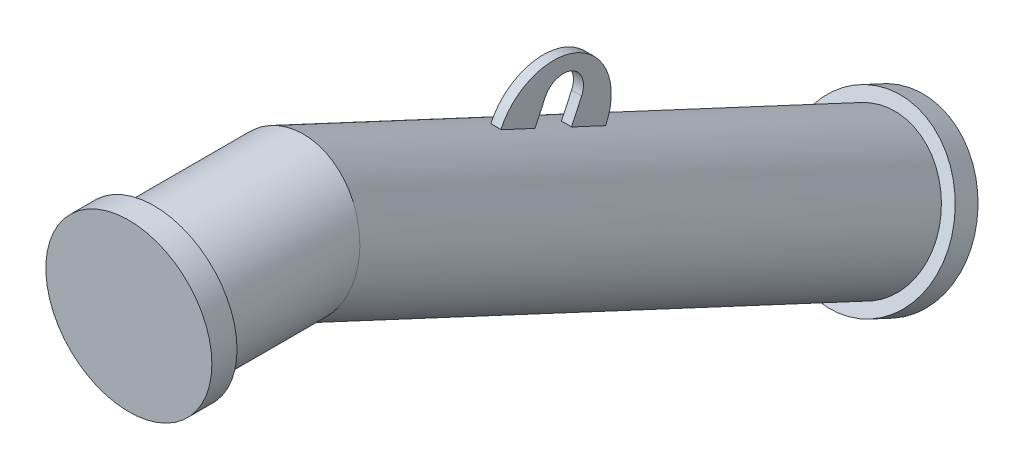
ISO-10303-21;
HEADER;
FILE_DESCRIPTION(('STEP AP214'),'2;1');
FILE_NAME('part.step','',(''),(''),'','','');
FILE_SCHEMA(('AUTOMOTIVE_DESIGN { 1 0 10303 214 1 1 1 1 }'));
ENDSEC;
DATA;
#1=APPLICATION_CONTEXT('core data for automotive mechanical design processes');
#2=APPLICATION_PROTOCOL_DEFINITION('international standard','automotive_design',2000,#1);
#3=PRODUCT_CONTEXT('',#1,'mechanical');
#4=PRODUCT('Part','Part','',(#3));
#5=PRODUCT_RELATED_PRODUCT_CATEGORY('part','',(#4));
#6=PRODUCT_DEFINITION_FORMATION('','',#4);
#7=PRODUCT_DEFINITION_CONTEXT('part definition',#1,'design');
#8=PRODUCT_DEFINITION('design','',#6,#7);
#9=PRODUCT_DEFINITION_SHAPE('','',#8);
#10=(LENGTH_UNIT() NAMED_UNIT(*) SI_UNIT(.MILLI.,.METRE.));
#11=(NAMED_UNIT(*) PLANE_ANGLE_UNIT() SI_UNIT($,.RADIAN.));
#12=(NAMED_UNIT(*) SI_UNIT($,.STERADIAN.) SOLID_ANGLE_UNIT());
#13=UNCERTAINTY_MEASURE_WITH_UNIT(LENGTH_MEASURE(1.E-05),#10,'distance_accuracy_value','');
#14=(GEOMETRIC_REPRESENTATION_CONTEXT(3) GLOBAL_UNCERTAINTY_ASSIGNED_CONTEXT((#13)) GLOBAL_UNIT_ASSIGNED_CONTEXT((#10,
#11,#12)) REPRESENTATION_CONTEXT('',''));
#15=CARTESIAN_POINT('',(0.,0.,0.));
#16=DIRECTION('',(0.,0.,1.));
#17=DIRECTION('',(1.,0.,0.));
#18=AXIS2_PLACEMENT_3D('',#15,#16,#17);
#19=CARTESIAN_POINT('',(5.00000000004126,-35.0356088594968,-398.785014069942));
#20=DIRECTION('',(0.,0.422618261740708,0.906307787036644));
#21=DIRECTION('',(0.,-0.906307787036647,0.42261826174071));
#22=AXIS2_PLACEMENT_3D('',#19,#20,#21);
#23=PLANE('',#22);
#24=DIRECTION('',(0.,0.906307787036647,-0.42261826174071));
#25=VECTOR('',#24,1.);
#26=CARTESIAN_POINT('',(5.00000000004126,-35.0356088594968,-398.785014069942));
#27=LINE('',#26,#25);
#28=CARTESIAN_POINT('',(5.00000000004056,-35.3339515462032,-398.645894590376));
#29=VERTEX_POINT('',#28);
#30=CARTESIAN_POINT('',(5.00000000004129,-13.7373758641353,-408.716543220848));
#31=VERTEX_POINT('',#30);
#32=EDGE_CURVE('E249',#29,#31,#27,.T.);
#33=ORIENTED_EDGE('',*,*,#32,.F.);
#34=CARTESIAN_POINT('',(0.,-98.4771539520796,-369.201735748084));
#35=DIRECTION('',(0.,0.422618261740708,0.906307787036644));
#36=DIRECTION('',(0.,-0.906307787036646,0.422618261740709));
#37=AXIS2_PLACEMENT_3D('',#34,#35,#36);
#38=CIRCLE('',#37,69.85);
#39=CARTESIAN_POINT('',(-4.99999999995944,-35.3339515461978,-398.645894590378));
#40=VERTEX_POINT('',#39);
#41=EDGE_CURVE('E224',#29,#40,#38,.T.);
#42=ORIENTED_EDGE('',*,*,#41,.T.);
#43=DIRECTION('',(0.,0.906307787036647,-0.42261826174071));
#44=VECTOR('',#43,1.);
#45=CARTESIAN_POINT('',(-4.99999999995874,-35.0356088594966,-398.785014069941));
#46=LINE('',#45,#44);
#47=CARTESIAN_POINT('',(-4.99999999995871,-13.7373758641352,-408.716543220848));
#48=VERTEX_POINT('',#47);
#49=EDGE_CURVE('E248',#40,#48,#46,.T.);
#50=ORIENTED_EDGE('',*,*,#49,.T.);
#51=DIRECTION('',(-1.,0.,0.));
#52=VECTOR('',#51,1.);
#53=CARTESIAN_POINT('',(5.00000000004129,-13.7373758641353,-408.716543220848));
#54=LINE('',#53,#52);
#55=EDGE_CURVE('E25',#31,#48,#54,.T.);
#56=ORIENTED_EDGE('',*,*,#55,.F.);
#57=EDGE_LOOP('',(#33,#42,#50,#56));
#58=FACE_BOUND('',#57,.T.);
#59=ADVANCED_FACE('F16',(#58),#23,.F.);
#60=CARTESIAN_POINT('',(5.00000000004135,-22.1897410989496,-426.842698961581));
#61=DIRECTION('',(-1.,0.,0.));
#62=DIRECTION('',(0.,-0.906307787036648,0.42261826174071));
#63=AXIS2_PLACEMENT_3D('',#60,#61,#62);
#64=CYLINDRICAL_SURFACE('',#63,20.);
#65=CARTESIAN_POINT('',(-4.99999999995866,-22.1897410989496,-426.842698961581));
#66=DIRECTION('',(-1.,0.,0.));
#67=DIRECTION('',(0.,0.906307787036648,-0.42261826174071));
#68=AXIS2_PLACEMENT_3D('',#65,#66,#67);
#69=CIRCLE('',#68,20.);
#70=CARTESIAN_POINT('',(-4.99999999995858,-30.6421063337638,-444.968854702314));
#71=VERTEX_POINT('',#70);
#72=EDGE_CURVE('E266',#48,#71,#69,.T.);
#73=ORIENTED_EDGE('',*,*,#72,.T.);
#74=DIRECTION('',(-1.,0.,0.));
#75=VECTOR('',#74,1.);
#76=CARTESIAN_POINT('',(5.00000000004142,-30.6421063337638,-444.968854702315));
#77=LINE('',#76,#75);
#78=CARTESIAN_POINT('',(5.00000000004142,-30.6421063337638,-444.968854702315));
#79=VERTEX_POINT('',#78);
#80=EDGE_CURVE('E283',#79,#71,#77,.T.);
#81=ORIENTED_EDGE('',*,*,#80,.F.);
#82=CARTESIAN_POINT('',(5.00000000004135,-22.1897410989496,-426.842698961581));
#83=DIRECTION('',(-1.,0.,0.));
#84=DIRECTION('',(0.,0.906307787036648,-0.42261826174071));
#85=AXIS2_PLACEMENT_3D('',#82,#83,#84);
#86=CIRCLE('',#85,20.);
#87=EDGE_CURVE('E252',#31,#79,#86,.T.);
#88=ORIENTED_EDGE('',*,*,#87,.F.);
#89=ORIENTED_EDGE('',*,*,#55,.T.);
#90=EDGE_LOOP('',(#73,#81,#88,#89));
#91=FACE_BOUND('',#90,.T.);
#92=ADVANCED_FACE('F296',(#91),#64,.F.);
#93=CARTESIAN_POINT('',(5.0000000000414,-51.940339329125,-435.037325551408));
#94=DIRECTION('',(0.,-0.422618261740708,-0.906307787036644));
#95=DIRECTION('',(0.,0.906307787036647,-0.42261826174071));
#96=AXIS2_PLACEMENT_3D('',#93,#94,#95);
#97=PLANE('',#96);
#98=DIRECTION('',(0.,-0.906307787036647,0.42261826174071));
#99=VECTOR('',#98,1.);
#100=CARTESIAN_POINT('',(-4.9999999999586,-51.9403393291251,-435.037325551408));
#101=LINE('',#100,#99);
#102=CARTESIAN_POINT('',(-4.99999999995937,-52.2386820158263,-434.898206071845));
#103=VERTEX_POINT('',#102);
#104=EDGE_CURVE('E269',#71,#103,#101,.T.);
#105=ORIENTED_EDGE('',*,*,#104,.T.);
#106=CARTESIAN_POINT('',(0.,-115.381884421708,-405.45404722955));
#107=DIRECTION('',(0.,-0.422618261740708,-0.906307787036644));
#108=DIRECTION('',(0.,0.906307787036646,-0.422618261740709));
#109=AXIS2_PLACEMENT_3D('',#106,#107,#108);
#110=CIRCLE('',#109,69.85);
#111=CARTESIAN_POINT('',(5.00000000004063,-52.2386820158313,-434.898206071842));
#112=VERTEX_POINT('',#111);
#113=EDGE_CURVE('E232',#103,#112,#110,.T.);
#114=ORIENTED_EDGE('',*,*,#113,.T.);
#115=DIRECTION('',(0.,-0.906307787036647,0.42261826174071));
#116=VECTOR('',#115,1.);
#117=CARTESIAN_POINT('',(5.0000000000414,-51.940339329125,-435.037325551408));
#118=LINE('',#117,#116);
#119=EDGE_CURVE('E256',#79,#112,#118,.T.);
#120=ORIENTED_EDGE('',*,*,#119,.F.);
#121=ORIENTED_EDGE('',*,*,#80,.T.);
#122=EDGE_LOOP('',(#105,#114,#120,#121));
#123=FACE_BOUND('',#122,.T.);
#124=ADVANCED_FACE('F306',(#123),#97,.F.);
#125=CARTESIAN_POINT('',(5.00000000004133,-43.4879740943109,-416.911169810675));
#126=DIRECTION('',(-1.,0.,0.));
#127=DIRECTION('',(0.,-0.906307787036648,0.42261826174071));
#128=AXIS2_PLACEMENT_3D('',#125,#126,#127);
#129=CYLINDRICAL_SURFACE('',#128,57.5);
#130=CARTESIAN_POINT('',(-4.99999999995867,-43.4879740943108,-416.911169810675));
#131=DIRECTION('',(1.,0.,0.));
#132=DIRECTION('',(0.,0.906307787036648,-0.42261826174071));
#133=AXIS2_PLACEMENT_3D('',#130,#131,#132);
#134=CIRCLE('',#133,57.5);
#135=CARTESIAN_POINT('',(-4.99999999995846,-67.7885241444018,-469.023867565282));
#136=VERTEX_POINT('',#135);
#137=CARTESIAN_POINT('',(-4.99999999995888,-19.1874240442202,-364.798472056067));
#138=VERTEX_POINT('',#137);
#139=EDGE_CURVE('E253',#136,#138,#134,.T.);
#140=ORIENTED_EDGE('',*,*,#139,.T.);
#141=DIRECTION('',(-1.,0.,0.));
#142=VECTOR('',#141,1.);
#143=CARTESIAN_POINT('',(5.00000000004112,-19.1874240442203,-364.798472056068));
#144=LINE('',#143,#142);
#145=CARTESIAN_POINT('',(5.00000000004112,-19.1874240442203,-364.798472056068));
#146=VERTEX_POINT('',#145);
#147=EDGE_CURVE('E263',#146,#138,#144,.T.);
#148=ORIENTED_EDGE('',*,*,#147,.F.);
#149=CARTESIAN_POINT('',(5.00000000004133,-43.4879740943109,-416.911169810675));
#150=DIRECTION('',(1.,0.,0.));
#151=DIRECTION('',(0.,0.906307787036648,-0.42261826174071));
#152=AXIS2_PLACEMENT_3D('',#149,#150,#151);
#153=CIRCLE('',#152,57.5);
#154=CARTESIAN_POINT('',(5.00000000004154,-67.7885241444016,-469.023867565282));
#155=VERTEX_POINT('',#154);
#156=EDGE_CURVE('E259',#155,#146,#153,.T.);
#157=ORIENTED_EDGE('',*,*,#156,.F.);
#158=DIRECTION('',(-1.,0.,0.));
#159=VECTOR('',#158,1.);
#160=CARTESIAN_POINT('',(5.00000000004154,-67.7885241444016,-469.023867565282));
#161=LINE('',#160,#159);
#162=EDGE_CURVE('E279',#155,#136,#161,.T.);
#163=ORIENTED_EDGE('',*,*,#162,.T.);
#164=EDGE_LOOP('',(#140,#148,#157,#163));
#165=FACE_BOUND('',#164,.T.);
#166=ADVANCED_FACE('F322',(#165),#129,.T.);
#167=CARTESIAN_POINT('',(5.00000000004135,-22.1897410989496,-426.842698961581));
#168=DIRECTION('',(1.,0.,0.));
#169=DIRECTION('',(0.,0.906307787036648,-0.42261826174071));
#170=AXIS2_PLACEMENT_3D('',#167,#168,#169);
#171=PLANE('',#170);
#172=DIRECTION('',(0.,-0.4226182617407,-0.90630778703665));
#173=VECTOR('',#172,1.);
#174=CARTESIAN_POINT('',(5.00000000003986,133.225200600753,-37.1696262960046));
#175=LINE('',#174,#173);
#176=CARTESIAN_POINT('',(5.00000000004154,-68.0868668311076,-468.884748085716));
#177=VERTEX_POINT('',#176);
#178=EDGE_CURVE('E225',#177,#112,#175,.F.);
#179=ORIENTED_EDGE('',*,*,#178,.F.);
#180=DIRECTION('',(0.,0.906307787036645,-0.422618261740709));
#181=VECTOR('',#180,1.);
#182=CARTESIAN_POINT('',(5.00000000004154,-76.8516020147681,-464.797684947875));
#183=LINE('',#182,#181);
#184=EDGE_CURVE('E242',#177,#155,#183,.T.);
#185=ORIENTED_EDGE('',*,*,#184,.T.);
#186=ORIENTED_EDGE('',*,*,#156,.T.);
#187=DIRECTION('',(0.,0.906307787036645,-0.422618261740709));
#188=VECTOR('',#187,1.);
#189=CARTESIAN_POINT('',(5.00000000004111,-28.2505019145867,-360.572289438661));
#190=LINE('',#189,#188);
#191=CARTESIAN_POINT('',(5.00000000004112,-19.4857667309272,-364.659352576502));
#192=VERTEX_POINT('',#191);
#193=EDGE_CURVE('E236',#192,#146,#190,.T.);
#194=ORIENTED_EDGE('',*,*,#193,.F.);
#195=EDGE_CURVE('E49',#29,#192,#175,.F.);
#196=ORIENTED_EDGE('',*,*,#195,.F.);
#197=ORIENTED_EDGE('',*,*,#32,.T.);
#198=ORIENTED_EDGE('',*,*,#87,.T.);
#199=ORIENTED_EDGE('',*,*,#119,.T.);
#200=EDGE_LOOP('',(#179,#185,#186,#194,#196,#197,#198,#199));
#201=FACE_BOUND('',#200,.T.);
#202=ADVANCED_FACE('F310',(#201),#171,.T.);
#203=CARTESIAN_POINT('',(-4.99999999995866,-22.1897410989496,-426.842698961581));
#204=DIRECTION('',(1.,0.,0.));
#205=DIRECTION('',(0.,0.906307787036648,-0.42261826174071));
#206=AXIS2_PLACEMENT_3D('',#203,#204,#205);
#207=PLANE('',#206);
#208=DIRECTION('',(0.,0.906307787036645,-0.422618261740709));
#209=VECTOR('',#208,1.);
#210=CARTESIAN_POINT('',(-4.99999999995847,-76.8516020147683,-464.797684947875));
#211=LINE('',#210,#209);
#212=CARTESIAN_POINT('',(-4.99999999995846,-68.0868668311023,-468.884748085719));
#213=VERTEX_POINT('',#212);
#214=EDGE_CURVE('E245',#213,#136,#211,.T.);
#215=ORIENTED_EDGE('',*,*,#214,.F.);
#216=DIRECTION('',(0.,-0.4226182617407,-0.90630778703665));
#217=VECTOR('',#216,1.);
#218=CARTESIAN_POINT('',(-4.99999999996014,133.225200600759,-37.169626296007));
#219=LINE('',#218,#217);
#220=EDGE_CURVE('E37',#213,#103,#219,.F.);
#221=ORIENTED_EDGE('',*,*,#220,.T.);
#222=ORIENTED_EDGE('',*,*,#104,.F.);
#223=ORIENTED_EDGE('',*,*,#72,.F.);
#224=ORIENTED_EDGE('',*,*,#49,.F.);
#225=CARTESIAN_POINT('',(-4.99999999995888,-19.4857667309218,-364.659352576504));
#226=VERTEX_POINT('',#225);
#227=EDGE_CURVE('E218',#40,#226,#219,.F.);
#228=ORIENTED_EDGE('',*,*,#227,.T.);
#229=DIRECTION('',(0.,0.906307787036645,-0.422618261740709));
#230=VECTOR('',#229,1.);
#231=CARTESIAN_POINT('',(-4.99999999995889,-28.2505019145866,-360.57228943866));
#232=LINE('',#231,#230);
#233=EDGE_CURVE('E239',#226,#138,#232,.T.);
#234=ORIENTED_EDGE('',*,*,#233,.T.);
#235=ORIENTED_EDGE('',*,*,#139,.F.);
#236=EDGE_LOOP('',(#215,#221,#222,#223,#224,#228,#234,#235));
#237=FACE_BOUND('',#236,.T.);
#238=ADVANCED_FACE('F304',(#237),#207,.F.);
#239=CARTESIAN_POINT('',(-4.99999999995847,-76.8516020147683,-464.797684947875));
#240=DIRECTION('',(0.,0.422618261740709,0.906307787036645));
#241=DIRECTION('',(0.,-0.906307787036645,0.422618261740709));
#242=AXIS2_PLACEMENT_3D('',#239,#240,#241);
#243=PLANE('',#242);
#244=ORIENTED_EDGE('',*,*,#184,.F.);
#245=CARTESIAN_POINT('',(0.,-131.230069236984,-439.440589243424));
#246=DIRECTION('',(0.,0.422618261740709,0.906307787036645));
#247=DIRECTION('',(0.,-0.906307787036645,0.422618261740709));
#248=AXIS2_PLACEMENT_3D('',#245,#246,#247);
#249=CIRCLE('',#248,69.85);
#250=EDGE_CURVE('E229',#177,#213,#249,.T.);
#251=ORIENTED_EDGE('',*,*,#250,.T.);
#252=ORIENTED_EDGE('',*,*,#214,.T.);
#253=ORIENTED_EDGE('',*,*,#162,.F.);
#254=EDGE_LOOP('',(#244,#251,#252,#253));
#255=FACE_BOUND('',#254,.T.);
#256=ADVANCED_FACE('F325',(#255),#243,.F.);
#257=CARTESIAN_POINT('',(5.00000000004111,-28.2505019145867,-360.572289438661));
#258=DIRECTION('',(0.,-0.422618261740709,-0.906307787036645));
#259=DIRECTION('',(0.,0.906307787036645,-0.422618261740709));
#260=AXIS2_PLACEMENT_3D('',#257,#258,#259);
#261=PLANE('',#260);
#262=ORIENTED_EDGE('',*,*,#233,.F.);
#263=CARTESIAN_POINT('',(0.,-82.6289691368034,-335.21519373421));
#264=DIRECTION('',(0.,-0.422618261740709,-0.906307787036645));
#265=DIRECTION('',(0.,0.906307787036645,-0.422618261740709));
#266=AXIS2_PLACEMENT_3D('',#263,#264,#265);
#267=CIRCLE('',#266,69.85);
#268=EDGE_CURVE('E10',#226,#192,#267,.T.);
#269=ORIENTED_EDGE('',*,*,#268,.T.);
#270=ORIENTED_EDGE('',*,*,#193,.T.);
#271=ORIENTED_EDGE('',*,*,#147,.T.);
#272=EDGE_LOOP('',(#262,#269,#270,#271));
#273=FACE_BOUND('',#272,.T.);
#274=ADVANCED_FACE('F318',(#273),#261,.F.);
#275=CARTESIAN_POINT('',(0.,70.0819981948767,-7.72546745371311));
#276=DIRECTION('',(0.,-0.4226182617407,-0.90630778703665));
#277=DIRECTION('',(1.,0.,0.));
#278=AXIS2_PLACEMENT_3D('',#275,#276,#277);
#279=CYLINDRICAL_SURFACE('',#278,69.85);
#280=ORIENTED_EDGE('',*,*,#41,.F.);
#281=ORIENTED_EDGE('',*,*,#195,.T.);
#282=ORIENTED_EDGE('',*,*,#268,.F.);
#283=ORIENTED_EDGE('',*,*,#227,.F.);
#284=EDGE_LOOP('',(#280,#281,#282,#283));
#285=FACE_BOUND('',#284,.T.);
#286=CARTESIAN_POINT('',(0.,1.11022302462519E-13,-158.016797585764));
#287=DIRECTION('',(0.,-0.216439613938103,-0.976296007119933));
#288=DIRECTION('',(0.,-0.976296007119933,0.216439613938103));
#289=AXIS2_PLACEMENT_3D('',#286,#287,#288);
#290=ELLIPSE('',#289,71.5459240748685,69.85);
#291=CARTESIAN_POINT('',(0.,-69.8499999999999,-142.531425400154));
#292=VERTEX_POINT('',#291);
#293=EDGE_CURVE('E214',#292,#292,#290,.F.);
#294=ORIENTED_EDGE('',*,*,#293,.F.);
#295=EDGE_LOOP('',(#294));
#296=FACE_BOUND('',#295,.T.);
#297=CARTESIAN_POINT('',(0.,-267.52445864836,-731.724850562744));
#298=DIRECTION('',(0.,-0.4226182617407,-0.90630778703665));
#299=DIRECTION('',(-1.,0.,0.));
#300=AXIS2_PLACEMENT_3D('',#297,#298,#299);
#301=CIRCLE('',#300,69.85);
#302=CARTESIAN_POINT('',(-69.85,-267.52445864836,-731.724850562744));
#303=VERTEX_POINT('',#302);
#304=EDGE_CURVE('E195',#303,#303,#301,.T.);
#305=ORIENTED_EDGE('',*,*,#304,.F.);
#306=EDGE_LOOP('',(#305));
#307=FACE_BOUND('',#306,.T.);
#308=ORIENTED_EDGE('',*,*,#113,.F.);
#309=ORIENTED_EDGE('',*,*,#220,.F.);
#310=ORIENTED_EDGE('',*,*,#250,.F.);
#311=ORIENTED_EDGE('',*,*,#178,.T.);
#312=EDGE_LOOP('',(#308,#309,#310,#311));
#313=FACE_BOUND('',#312,.T.);
#314=ADVANCED_FACE('F313',(#285,#296,#307,#313),#279,.T.);
#315=CARTESIAN_POINT('',(4.27297086602607E-11,-278.089915191863,-754.382545238666));
#316=DIRECTION('',(0.,-0.422618261740666,-0.906307787036578));
#317=DIRECTION('',(1.00000000000005,0.,0.));
#318=AXIS2_PLACEMENT_3D('',#315,#316,#317);
#319=PLANE('',#318);
#320=CARTESIAN_POINT('',(4.27297086602607E-11,-278.089915191863,-754.382545238666));
#321=DIRECTION('',(0.,-0.422618261740666,-0.906307787036578));
#322=DIRECTION('',(1.00000000000005,0.,0.));
#323=AXIS2_PLACEMENT_3D('',#320,#321,#322);
#324=CIRCLE('',#323,82.5);
#325=CARTESIAN_POINT('',(82.5000000000472,-278.089915191862,-754.382545238666));
#326=VERTEX_POINT('',#325);
#327=EDGE_CURVE('E202',#326,#326,#324,.T.);
#328=ORIENTED_EDGE('',*,*,#327,.T.);
#329=EDGE_LOOP('',(#328));
#330=FACE_BOUND('',#329,.T.);
#331=ADVANCED_FACE('F543',(#330),#319,.T.);
#332=CARTESIAN_POINT('',(0.,-267.52445864836,-731.724850562744));
#333=DIRECTION('',(0.,-0.422618261740666,-0.906307787036578));
#334=DIRECTION('',(1.00000000000005,0.,0.));
#335=AXIS2_PLACEMENT_3D('',#332,#333,#334);
#336=CYLINDRICAL_SURFACE('',#335,82.5);
#337=CARTESIAN_POINT('',(0.,-267.52445864836,-731.724850562744));
#338=DIRECTION('',(0.,-0.422618261740666,-0.906307787036578));
#339=DIRECTION('',(1.00000000000005,0.,0.));
#340=AXIS2_PLACEMENT_3D('',#337,#338,#339);
#341=CIRCLE('',#340,82.5);
#342=CARTESIAN_POINT('',(82.5000000000045,-267.524458648359,-731.724850562744));
#343=VERTEX_POINT('',#342);
#344=EDGE_CURVE('E203',#343,#343,#341,.T.);
#345=ORIENTED_EDGE('',*,*,#344,.T.);
#346=EDGE_LOOP('',(#345));
#347=FACE_BOUND('',#346,.T.);
#348=ORIENTED_EDGE('',*,*,#327,.F.);
#349=EDGE_LOOP('',(#348));
#350=FACE_BOUND('',#349,.T.);
#351=ADVANCED_FACE('F339',(#347,#350),#336,.T.);
#352=CARTESIAN_POINT('',(0.,-267.52445864836,-731.724850562744));
#353=DIRECTION('',(0.,-0.422618261740666,-0.906307787036578));
#354=DIRECTION('',(1.00000000000005,0.,0.));
#355=AXIS2_PLACEMENT_3D('',#352,#353,#354);
#356=PLANE('',#355);
#357=ORIENTED_EDGE('',*,*,#304,.T.);
#358=EDGE_LOOP('',(#357));
#359=FACE_BOUND('',#358,.T.);
#360=ORIENTED_EDGE('',*,*,#344,.F.);
#361=EDGE_LOOP('',(#360));
#362=FACE_BOUND('',#361,.T.);
#363=ADVANCED_FACE('F394',(#359,#362),#356,.F.);
#364=CARTESIAN_POINT('',(0.,0.,0.));
#365=DIRECTION('',(0.,0.,0.99999999999992));
#366=DIRECTION('',(1.00000000000005,0.,0.));
#367=AXIS2_PLACEMENT_3D('',#364,#365,#366);
#368=PLANE('',#367);
#369=CARTESIAN_POINT('',(0.,0.,0.));
#370=DIRECTION('',(0.,0.,0.99999999999992));
#371=DIRECTION('',(1.00000000000005,0.,0.));
#372=AXIS2_PLACEMENT_3D('',#369,#370,#371);
#373=CIRCLE('',#372,82.5);
#374=CARTESIAN_POINT('',(82.5000000000045,-8.30125381772406E-13,-2.8829457827577E-13));
#375=VERTEX_POINT('',#374);
#376=EDGE_CURVE('E183',#375,#375,#373,.T.);
#377=ORIENTED_EDGE('',*,*,#376,.T.);
#378=EDGE_LOOP('',(#377));
#379=FACE_BOUND('',#378,.T.);
#380=ADVANCED_FACE('F398',(#379),#368,.T.);
#381=CARTESIAN_POINT('',(-4.26333975374987E-11,1.61815005839117E-11,-24.9999999999994));
#382=DIRECTION('',(0.,0.,0.99999999999992));
#383=DIRECTION('',(1.00000000000005,0.,0.));
#384=AXIS2_PLACEMENT_3D('',#381,#382,#383);
#385=CYLINDRICAL_SURFACE('',#384,82.5);
#386=CARTESIAN_POINT('',(-4.26333975374987E-11,1.61815005839117E-11,-24.9999999999994));
#387=DIRECTION('',(0.,0.,0.99999999999992));
#388=DIRECTION('',(1.00000000000005,0.,0.));
#389=AXIS2_PLACEMENT_3D('',#386,#387,#388);
#390=CIRCLE('',#389,82.5);
#391=CARTESIAN_POINT('',(82.4999999999618,1.53513752021393E-11,-24.9999999999996));
#392=VERTEX_POINT('',#391);
#393=EDGE_CURVE('E191',#392,#392,#390,.T.);
#394=ORIENTED_EDGE('',*,*,#393,.T.);
#395=EDGE_LOOP('',(#394));
#396=FACE_BOUND('',#395,.T.);
#397=ORIENTED_EDGE('',*,*,#376,.F.);
#398=EDGE_LOOP('',(#397));
#399=FACE_BOUND('',#398,.T.);
#400=ADVANCED_FACE('F437',(#396,#399),#385,.T.);
#401=CARTESIAN_POINT('',(-4.26333975374987E-11,1.61815005839117E-11,-24.9999999999994));
#402=DIRECTION('',(0.,0.,0.99999999999992));
#403=DIRECTION('',(1.00000000000005,0.,0.));
#404=AXIS2_PLACEMENT_3D('',#401,#402,#403);
#405=PLANE('',#404);
#406=CARTESIAN_POINT('',(0.,1.11022302462519E-13,-24.9999999999994));
#407=DIRECTION('',(0.,0.,1.));
#408=DIRECTION('',(1.,0.,0.));
#409=AXIS2_PLACEMENT_3D('',#406,#407,#408);
#410=CIRCLE('',#409,69.85);
#411=CARTESIAN_POINT('',(69.85,1.11022302462519E-13,-24.9999999999994));
#412=VERTEX_POINT('',#411);
#413=EDGE_CURVE('E207',#412,#412,#410,.T.);
#414=ORIENTED_EDGE('',*,*,#413,.T.);
#415=EDGE_LOOP('',(#414));
#416=FACE_BOUND('',#415,.T.);
#417=ORIENTED_EDGE('',*,*,#393,.F.);
#418=EDGE_LOOP('',(#417));
#419=FACE_BOUND('',#418,.T.);
#420=ADVANCED_FACE('F772',(#416,#419),#405,.F.);
#421=CARTESIAN_POINT('',(0.,1.11022302462519E-13,-323.844932664971));
#422=DIRECTION('',(0.,0.,1.));
#423=DIRECTION('',(1.,0.,0.));
#424=AXIS2_PLACEMENT_3D('',#421,#422,#423);
#425=CYLINDRICAL_SURFACE('',#424,69.85);
#426=ORIENTED_EDGE('',*,*,#413,.F.);
#427=EDGE_LOOP('',(#426));
#428=FACE_BOUND('',#427,.T.);
#429=ORIENTED_EDGE('',*,*,#293,.T.);
#430=EDGE_LOOP('',(#429));
#431=FACE_BOUND('',#430,.T.);
#432=ADVANCED_FACE('F766',(#428,#431),#425,.T.);
#433=CLOSED_SHELL('',(#59,#92,#124,#166,#202,#238,#256,#274,#314,#331,#351,#363,#380,#400,#420,#432));
#434=CARTESIAN_POINT('',(0.,0.,-25.));
#435=DIRECTION('',(0.,0.,1.));
#436=DIRECTION('',(1.,0.,0.));
#437=AXIS2_PLACEMENT_3D('',#434,#435,#436);
#438=PLANE('',#437);
#439=CARTESIAN_POINT('',(0.,1.11022302462519E-13,-24.9999999999994));
#440=DIRECTION('',(0.,0.,-1.));
#441=DIRECTION('',(0.,1.,0.));
#442=AXIS2_PLACEMENT_3D('',#439,#440,#441);
#443=CIRCLE('',#442,27.);
#444=CARTESIAN_POINT('',(0.,27.0000000000001,-24.9999999999994));
#445=VERTEX_POINT('',#444);
#446=EDGE_CURVE('E184',#445,#445,#443,.T.);
#447=ORIENTED_EDGE('',*,*,#446,.T.);
#448=EDGE_LOOP('',(#447));
#449=FACE_BOUND('',#448,.T.);
#450=ADVANCED_FACE('F749',(#449),#438,.F.);
#451=CARTESIAN_POINT('',(0.,-600.,-24.9999999999994));
#452=DIRECTION('',(-1.,0.,0.));
#453=DIRECTION('',(0.,0.,1.));
#454=AXIS2_PLACEMENT_3D('',#451,#452,#453);
#455=TOROIDAL_SURFACE('',#454,600.,27.);
#456=CARTESIAN_POINT('',(0.,-56.2153277780094,-278.570957044419));
#457=DIRECTION('',(0.,0.422618261740702,0.906307787036653));
#458=DIRECTION('',(1.,0.,0.));
#459=AXIS2_PLACEMENT_3D('',#456,#457,#458);
#460=CIRCLE('',#459,27.);
#461=CARTESIAN_POINT('',(0.,-31.7450175280201,-289.981650111417));
#462=VERTEX_POINT('',#461);
#463=EDGE_CURVE('E178',#462,#462,#460,.T.);
#464=CARTESIAN_POINT('',(0.,-600.,-24.9999999999994));
#465=DIRECTION('',(-1.,0.,0.));
#466=DIRECTION('',(0.,0.,1.));
#467=AXIS2_PLACEMENT_3D('',#464,#465,#466);
#468=CIRCLE('',#467,627.);
#469=EDGE_CURVE('',#445,#462,#468,.T.);
#470=ORIENTED_EDGE('',*,*,#446,.F.);
#471=ORIENTED_EDGE('',*,*,#463,.F.);
#472=ORIENTED_EDGE('',*,*,#469,.T.);
#473=ORIENTED_EDGE('',*,*,#469,.F.);
#474=EDGE_LOOP('',(#470,#472,#471,#473));
#475=FACE_BOUND('',#474,.T.);
#476=ADVANCED_FACE('F535',(#475),#455,.F.);
#477=CARTESIAN_POINT('',(0.,-56.2153277780094,-278.570957044419));
#478=DIRECTION('',(0.,-0.422618261740702,-0.906307787036653));
#479=DIRECTION('',(-1.,0.,0.));
#480=AXIS2_PLACEMENT_3D('',#477,#478,#479);
#481=CYLINDRICAL_SURFACE('',#480,27.);
#482=ORIENTED_EDGE('',*,*,#463,.T.);
#483=EDGE_LOOP('',(#482));
#484=FACE_BOUND('',#483,.T.);
#485=CARTESIAN_POINT('',(0.,-275.976823883172,-749.851006303473));
#486=DIRECTION('',(0.,0.422618261740666,0.906307787036578));
#487=DIRECTION('',(0.,-0.90630778703665,0.4226182617407));
#488=AXIS2_PLACEMENT_3D('',#485,#486,#487);
#489=CIRCLE('',#488,27.);
#490=CARTESIAN_POINT('',(0.,-300.447134133162,-738.440313236474));
#491=VERTEX_POINT('',#490);
#492=EDGE_CURVE('E179',#491,#491,#489,.T.);
#493=ORIENTED_EDGE('',*,*,#492,.F.);
#494=EDGE_LOOP('',(#493));
#495=FACE_BOUND('',#494,.T.);
#496=ADVANCED_FACE('F530',(#484,#495),#481,.F.);
#497=CARTESIAN_POINT('',(-4.78824203959246E-11,-275.976823883131,-749.851006303493));
#498=DIRECTION('',(0.,0.422618261740666,0.906307787036578));
#499=DIRECTION('',(-1.00000000000005,0.,0.));
#500=AXIS2_PLACEMENT_3D('',#497,#498,#499);
#501=PLANE('',#500);
#502=ORIENTED_EDGE('',*,*,#492,.T.);
#503=EDGE_LOOP('',(#502));
#504=FACE_BOUND('',#503,.T.);
#505=ADVANCED_FACE('F534',(#504),#501,.T.);
#506=CLOSED_SHELL('',(#450,#476,#496,#505));
#507=CARTESIAN_POINT('',(44.1941738241594,-309.691073835547,-717.579124577288));
#508=DIRECTION('',(0.,-0.422618261740666,-0.906307787036578));
#509=DIRECTION('',(0.,0.90630778703665,-0.4226182617407));
#510=AXIS2_PLACEMENT_3D('',#507,#508,#509);
#511=PLANE('',#510);
#512=CARTESIAN_POINT('',(44.1941738241594,-309.691073835547,-717.579124577288));
#513=DIRECTION('',(0.,-0.422618261740666,-0.906307787036578));
#514=DIRECTION('',(1.00000000000005,0.,0.));
#515=AXIS2_PLACEMENT_3D('',#512,#513,#514);
#516=CIRCLE('',#515,7.);
#517=CARTESIAN_POINT('',(51.1941738241598,-309.691073835547,-717.579124577288));
#518=VERTEX_POINT('',#517);
#519=EDGE_CURVE('E163',#518,#518,#516,.T.);
#520=ORIENTED_EDGE('',*,*,#519,.F.);
#521=EDGE_LOOP('',(#520));
#522=FACE_BOUND('',#521,.T.);
#523=ADVANCED_FACE('F717',(#522),#511,.F.);
#524=CARTESIAN_POINT('',(44.1941738241594,-309.691073835547,-717.579124577288));
#525=DIRECTION('',(0.,-0.422618261740666,-0.906307787036578));
#526=DIRECTION('',(1.00000000000005,0.,0.));
#527=AXIS2_PLACEMENT_3D('',#524,#525,#526);
#528=CONICAL_SURFACE('',#527,7.,1.02974425867665);
#529=CARTESIAN_POINT('',(44.1941738241595,-307.913531143008,-713.767171971665));
#530=VERTEX_POINT('',#529);
#531=VERTEX_LOOP('',#530);
#532=FACE_BOUND('',#531,.T.);
#533=ORIENTED_EDGE('',*,*,#519,.T.);
#534=EDGE_LOOP('',(#533));
#535=FACE_BOUND('',#534,.T.);
#536=ADVANCED_FACE('F712',(#532,#535),#528,.F.);
#537=CLOSED_SHELL('',(#523,#536));
#538=CARTESIAN_POINT('',(44.1941738241223,-229.584026078605,-754.933654418583));
#539=DIRECTION('',(0.,-0.422618261740666,-0.906307787036578));
#540=DIRECTION('',(0.,0.90630778703665,-0.4226182617407));
#541=AXIS2_PLACEMENT_3D('',#538,#539,#540);
#542=PLANE('',#541);
#543=CARTESIAN_POINT('',(44.1941738241223,-229.584026078605,-754.933654418583));
#544=DIRECTION('',(0.,-0.422618261740666,-0.906307787036578));
#545=DIRECTION('',(1.00000000000005,0.,0.));
#546=AXIS2_PLACEMENT_3D('',#543,#544,#545);
#547=CIRCLE('',#546,7.);
#548=CARTESIAN_POINT('',(51.1941738241226,-229.584026078605,-754.933654418583));
#549=VERTEX_POINT('',#548);
#550=EDGE_CURVE('E168',#549,#549,#547,.T.);
#551=ORIENTED_EDGE('',*,*,#550,.F.);
#552=EDGE_LOOP('',(#551));
#553=FACE_BOUND('',#552,.T.);
#554=ADVANCED_FACE('F372',(#553),#542,.F.);
#555=CARTESIAN_POINT('',(44.1941738241223,-229.584026078605,-754.933654418583));
#556=DIRECTION('',(0.,-0.422618261740666,-0.906307787036578));
#557=DIRECTION('',(1.00000000000005,0.,0.));
#558=AXIS2_PLACEMENT_3D('',#555,#556,#557);
#559=CONICAL_SURFACE('',#558,7.,1.02974425867665);
#560=CARTESIAN_POINT('',(44.1941738240814,-227.806483386052,-751.121701812967));
#561=VERTEX_POINT('',#560);
#562=VERTEX_LOOP('',#561);
#563=FACE_BOUND('',#562,.T.);
#564=ORIENTED_EDGE('',*,*,#550,.T.);
#565=EDGE_LOOP('',(#564));
#566=FACE_BOUND('',#565,.T.);
#567=ADVANCED_FACE('F376',(#563,#566),#559,.F.);
#568=CLOSED_SHELL('',(#554,#567));
#569=CARTESIAN_POINT('',(-44.1941738241969,-229.584026078685,-754.933654418515));
#570=DIRECTION('',(0.,-0.422618261740666,-0.906307787036578));
#571=DIRECTION('',(0.,0.90630778703665,-0.4226182617407));
#572=AXIS2_PLACEMENT_3D('',#569,#570,#571);
#573=PLANE('',#572);
#574=CARTESIAN_POINT('',(-44.1941738241969,-229.584026078685,-754.933654418515));
#575=DIRECTION('',(0.,-0.422618261740666,-0.906307787036578));
#576=DIRECTION('',(1.00000000000005,0.,0.));
#577=AXIS2_PLACEMENT_3D('',#574,#575,#576);
#578=CIRCLE('',#577,6.99999999999999);
#579=CARTESIAN_POINT('',(-37.1941738241965,-229.584026078685,-754.933654418515));
#580=VERTEX_POINT('',#579);
#581=EDGE_CURVE('E153',#580,#580,#578,.T.);
#582=ORIENTED_EDGE('',*,*,#581,.F.);
#583=EDGE_LOOP('',(#582));
#584=FACE_BOUND('',#583,.T.);
#585=ADVANCED_FACE('F691',(#584),#573,.F.);
#586=CARTESIAN_POINT('',(-44.1941738241969,-229.584026078685,-754.933654418515));
#587=DIRECTION('',(0.,-0.422618261740666,-0.906307787036578));
#588=DIRECTION('',(1.00000000000005,0.,0.));
#589=AXIS2_PLACEMENT_3D('',#586,#587,#588);
#590=CONICAL_SURFACE('',#589,6.99999999999999,1.02974425867665);
#591=CARTESIAN_POINT('',(-44.1941738242378,-227.806483386153,-751.121701812873));
#592=VERTEX_POINT('',#591);
#593=VERTEX_LOOP('',#592);
#594=FACE_BOUND('',#593,.T.);
#595=ORIENTED_EDGE('',*,*,#581,.T.);
#596=EDGE_LOOP('',(#595));
#597=FACE_BOUND('',#596,.T.);
#598=ADVANCED_FACE('F596',(#594,#597),#590,.F.);
#599=CLOSED_SHELL('',(#585,#598));
#600=CARTESIAN_POINT('',(-44.1941738242024,44.1941738242918,-20.000000000036));
#601=DIRECTION('',(0.,0.,0.99999999999992));
#602=DIRECTION('',(0.,-1.,0.));
#603=AXIS2_PLACEMENT_3D('',#600,#601,#602);
#604=PLANE('',#603);
#605=CARTESIAN_POINT('',(-44.1941738242024,44.1941738242918,-20.000000000036));
#606=DIRECTION('',(0.,0.,0.99999999999992));
#607=DIRECTION('',(1.00000000000005,0.,0.));
#608=AXIS2_PLACEMENT_3D('',#605,#606,#607);
#609=CIRCLE('',#608,7.);
#610=CARTESIAN_POINT('',(-37.194173824202,44.1941738242917,-20.000000000036));
#611=VERTEX_POINT('',#610);
#612=EDGE_CURVE('E145',#611,#611,#609,.T.);
#613=ORIENTED_EDGE('',*,*,#612,.F.);
#614=EDGE_LOOP('',(#613));
#615=FACE_BOUND('',#614,.T.);
#616=ADVANCED_FACE('F607',(#615),#604,.F.);
#617=CARTESIAN_POINT('',(-44.1941738242024,44.1941738242918,-20.000000000036));
#618=DIRECTION('',(0.,0.,0.99999999999992));
#619=DIRECTION('',(1.00000000000005,0.,0.));
#620=AXIS2_PLACEMENT_3D('',#617,#618,#619);
#621=CONICAL_SURFACE('',#620,7.,1.02974425867665);
#622=CARTESIAN_POINT('',(-44.1941738242023,44.1941738243044,-24.2060243332216));
#623=VERTEX_POINT('',#622);
#624=VERTEX_LOOP('',#623);
#625=FACE_BOUND('',#624,.T.);
#626=ORIENTED_EDGE('',*,*,#612,.T.);
#627=EDGE_LOOP('',(#626));
#628=FACE_BOUND('',#627,.T.);
#629=ADVANCED_FACE('F602',(#625,#628),#621,.F.);
#630=CLOSED_SHELL('',(#616,#629));
#631=CARTESIAN_POINT('',(44.1941738241168,44.1941738241749,-20.0000000000066));
#632=DIRECTION('',(0.,0.,0.99999999999992));
#633=DIRECTION('',(0.,-1.,0.));
#634=AXIS2_PLACEMENT_3D('',#631,#632,#633);
#635=PLANE('',#634);
#636=CARTESIAN_POINT('',(44.1941738241168,44.1941738241749,-20.0000000000066));
#637=DIRECTION('',(0.,0.,0.99999999999992));
#638=DIRECTION('',(1.00000000000005,0.,0.));
#639=AXIS2_PLACEMENT_3D('',#636,#637,#638);
#640=CIRCLE('',#639,7.);
#641=CARTESIAN_POINT('',(51.1941738241172,44.1941738241748,-20.0000000000066));
#642=VERTEX_POINT('',#641);
#643=EDGE_CURVE('E142',#642,#642,#640,.T.);
#644=ORIENTED_EDGE('',*,*,#643,.F.);
#645=EDGE_LOOP('',(#644));
#646=FACE_BOUND('',#645,.T.);
#647=ADVANCED_FACE('F136',(#646),#635,.F.);
#648=CARTESIAN_POINT('',(44.1941738241168,44.1941738241749,-20.0000000000066));
#649=DIRECTION('',(0.,0.,0.99999999999992));
#650=DIRECTION('',(1.00000000000005,0.,0.));
#651=AXIS2_PLACEMENT_3D('',#648,#649,#650);
#652=CONICAL_SURFACE('',#651,7.,1.02974425867665);
#653=CARTESIAN_POINT('',(44.1941738241169,44.1941738241636,-24.2060243331876));
#654=VERTEX_POINT('',#653);
#655=VERTEX_LOOP('',#654);
#656=FACE_BOUND('',#655,.T.);
#657=ORIENTED_EDGE('',*,*,#643,.T.);
#658=EDGE_LOOP('',(#657));
#659=FACE_BOUND('',#658,.T.);
#660=ADVANCED_FACE('F133',(#656,#659),#652,.F.);
#661=CLOSED_SHELL('',(#647,#660));
#662=CARTESIAN_POINT('',(44.1941738240796,-44.1941738241277,-19.9999999999665));
#663=DIRECTION('',(0.,0.,0.99999999999992));
#664=DIRECTION('',(0.,-1.,0.));
#665=AXIS2_PLACEMENT_3D('',#662,#663,#664);
#666=PLANE('',#665);
#667=CARTESIAN_POINT('',(44.1941738240796,-44.1941738241277,-19.9999999999665));
#668=DIRECTION('',(0.,0.,0.99999999999992));
#669=DIRECTION('',(1.00000000000005,0.,0.));
#670=AXIS2_PLACEMENT_3D('',#667,#668,#669);
#671=CIRCLE('',#670,7.);
#672=CARTESIAN_POINT('',(51.1941738240799,-44.1941738241278,-19.9999999999665));
#673=VERTEX_POINT('',#672);
#674=EDGE_CURVE('E146',#673,#673,#671,.T.);
#675=ORIENTED_EDGE('',*,*,#674,.F.);
#676=EDGE_LOOP('',(#675));
#677=FACE_BOUND('',#676,.T.);
#678=ADVANCED_FACE('F491',(#677),#666,.F.);
#679=CARTESIAN_POINT('',(44.1941738240796,-44.1941738241277,-19.9999999999665));
#680=DIRECTION('',(0.,0.,0.99999999999992));
#681=DIRECTION('',(1.00000000000005,0.,0.));
#682=AXIS2_PLACEMENT_3D('',#679,#680,#681);
#683=CONICAL_SURFACE('',#682,7.,1.02974425867665);
#684=CARTESIAN_POINT('',(44.1941738240387,-44.1941738241548,-24.2060243331471));
#685=VERTEX_POINT('',#684);
#686=VERTEX_LOOP('',#685);
#687=FACE_BOUND('',#686,.T.);
#688=ORIENTED_EDGE('',*,*,#674,.T.);
#689=EDGE_LOOP('',(#688));
#690=FACE_BOUND('',#689,.T.);
#691=ADVANCED_FACE('F495',(#687,#690),#683,.F.);
#692=CLOSED_SHELL('',(#678,#691));
#693=CARTESIAN_POINT('',(-44.1941738242396,-44.1941738240259,-19.9999999999942));
#694=DIRECTION('',(0.,0.,0.99999999999992));
#695=DIRECTION('',(0.,-1.,0.));
#696=AXIS2_PLACEMENT_3D('',#693,#694,#695);
#697=PLANE('',#696);
#698=CARTESIAN_POINT('',(-44.1941738242396,-44.1941738240259,-19.9999999999942));
#699=DIRECTION('',(0.,0.,0.99999999999992));
#700=DIRECTION('',(1.00000000000005,0.,0.));
#701=AXIS2_PLACEMENT_3D('',#698,#699,#700);
#702=CIRCLE('',#701,6.99999999999999);
#703=CARTESIAN_POINT('',(-37.1941738242392,-44.194173824026,-19.9999999999943));
#704=VERTEX_POINT('',#703);
#705=EDGE_CURVE('E157',#704,#704,#702,.T.);
#706=ORIENTED_EDGE('',*,*,#705,.F.);
#707=EDGE_LOOP('',(#706));
#708=FACE_BOUND('',#707,.T.);
#709=ADVANCED_FACE('F363',(#708),#697,.F.);
#710=CARTESIAN_POINT('',(-44.1941738242396,-44.1941738240259,-19.9999999999942));
#711=DIRECTION('',(0.,0.,0.99999999999992));
#712=DIRECTION('',(1.00000000000005,0.,0.));
#713=AXIS2_PLACEMENT_3D('',#710,#711,#712);
#714=CONICAL_SURFACE('',#713,6.99999999999999,1.02974425867665);
#715=CARTESIAN_POINT('',(-44.1941738242804,-44.1941738240239,-24.2060243331903));
#716=VERTEX_POINT('',#715);
#717=VERTEX_LOOP('',#716);
#718=FACE_BOUND('',#717,.T.);
#719=ORIENTED_EDGE('',*,*,#705,.T.);
#720=EDGE_LOOP('',(#719));
#721=FACE_BOUND('',#720,.T.);
#722=ADVANCED_FACE('F359',(#718,#721),#714,.F.);
#723=CLOSED_SHELL('',(#709,#722));
#724=CARTESIAN_POINT('',(-44.1941738241597,-309.69107383564,-717.579124577212));
#725=DIRECTION('',(0.,-0.422618261740666,-0.906307787036578));
#726=DIRECTION('',(0.,0.90630778703665,-0.4226182617407));
#727=AXIS2_PLACEMENT_3D('',#724,#725,#726);
#728=PLANE('',#727);
#729=CARTESIAN_POINT('',(-44.1941738241597,-309.69107383564,-717.579124577212));
#730=DIRECTION('',(0.,-0.422618261740666,-0.906307787036578));
#731=DIRECTION('',(1.00000000000005,0.,0.));
#732=AXIS2_PLACEMENT_3D('',#729,#730,#731);
#733=CIRCLE('',#732,7.);
#734=CARTESIAN_POINT('',(-37.1941738241594,-309.69107383564,-717.579124577212));
#735=VERTEX_POINT('',#734);
#736=EDGE_CURVE('E167',#735,#735,#733,.T.);
#737=ORIENTED_EDGE('',*,*,#736,.F.);
#738=EDGE_LOOP('',(#737));
#739=FACE_BOUND('',#738,.T.);
#740=ADVANCED_FACE('F414',(#739),#728,.F.);
#741=CARTESIAN_POINT('',(-44.1941738241597,-309.69107383564,-717.579124577212));
#742=DIRECTION('',(0.,-0.422618261740666,-0.906307787036578));
#743=DIRECTION('',(1.00000000000005,0.,0.));
#744=AXIS2_PLACEMENT_3D('',#741,#742,#743);
#745=CONICAL_SURFACE('',#744,7.,1.02974425867665);
#746=CARTESIAN_POINT('',(-44.1941738241596,-307.913531143122,-713.767171971575));
#747=VERTEX_POINT('',#746);
#748=VERTEX_LOOP('',#747);
#749=FACE_BOUND('',#748,.T.);
#750=ORIENTED_EDGE('',*,*,#736,.T.);
#751=EDGE_LOOP('',(#750));
#752=FACE_BOUND('',#751,.T.);
#753=ADVANCED_FACE('F418',(#749,#752),#745,.F.);
#754=CLOSED_SHELL('',(#740,#753));
#755=ORIENTED_CLOSED_SHELL('',*,#506,.T.);
#756=ORIENTED_CLOSED_SHELL('',*,#537,.T.);
#757=ORIENTED_CLOSED_SHELL('',*,#568,.T.);
#758=ORIENTED_CLOSED_SHELL('',*,#599,.T.);
#759=ORIENTED_CLOSED_SHELL('',*,#630,.T.);
#760=ORIENTED_CLOSED_SHELL('',*,#661,.T.);
#761=ORIENTED_CLOSED_SHELL('',*,#692,.T.);
#762=ORIENTED_CLOSED_SHELL('',*,#723,.T.);
#763=ORIENTED_CLOSED_SHELL('',*,#754,.T.);
#764=BREP_WITH_VOIDS('B1',#433,(#755,#756,#757,#758,#759,#760,#761,#762,#763));
#765=ADVANCED_BREP_SHAPE_REPRESENTATION('',(#18,#764),#14);
#766=SHAPE_DEFINITION_REPRESENTATION(#9,#765);
ENDSEC;
END-ISO-10303-21;
